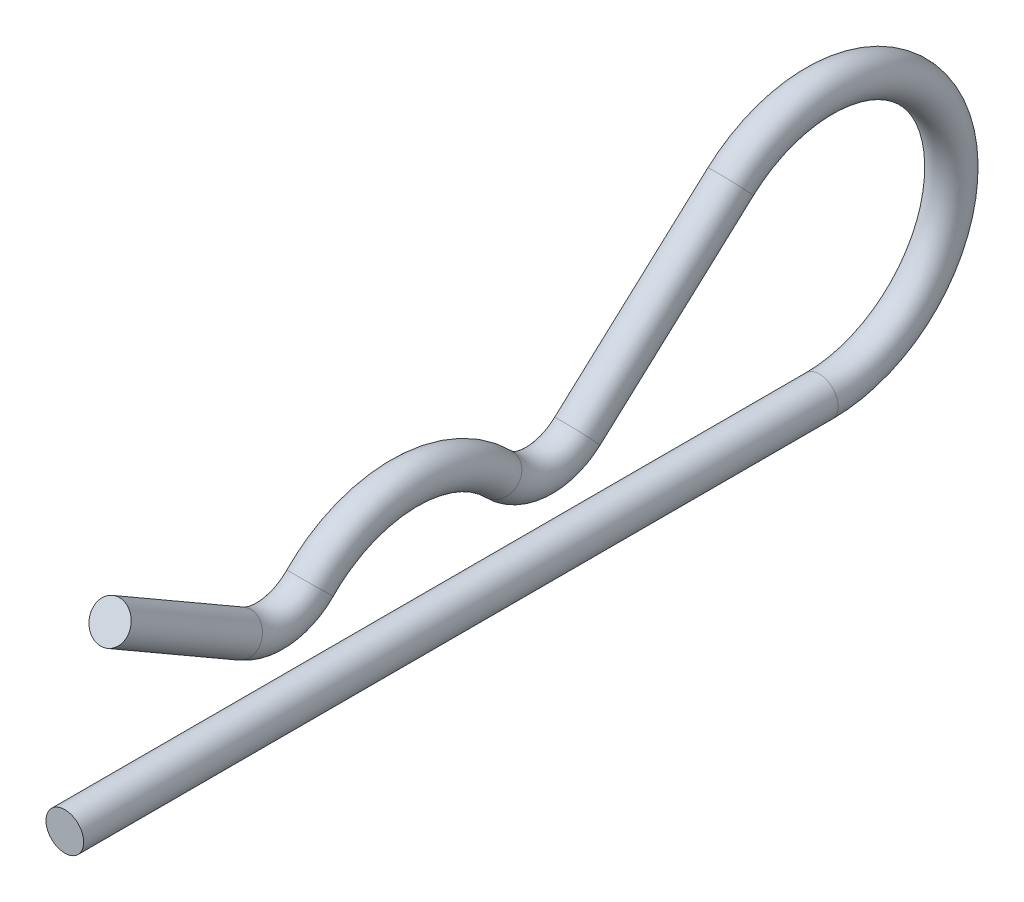
ISO-10303-21;
HEADER;
FILE_DESCRIPTION(('STEP AP214'),'2;1');
FILE_NAME('part.step','',(''),(''),'','','');
FILE_SCHEMA(('AUTOMOTIVE_DESIGN { 1 0 10303 214 1 1 1 1 }'));
ENDSEC;
DATA;
#1=APPLICATION_CONTEXT('core data for automotive mechanical design processes');
#2=APPLICATION_PROTOCOL_DEFINITION('international standard','automotive_design',2000,#1);
#3=PRODUCT_CONTEXT('',#1,'mechanical');
#4=PRODUCT('Part','Part','',(#3));
#5=PRODUCT_RELATED_PRODUCT_CATEGORY('part','',(#4));
#6=PRODUCT_DEFINITION_FORMATION('','',#4);
#7=PRODUCT_DEFINITION_CONTEXT('part definition',#1,'design');
#8=PRODUCT_DEFINITION('design','',#6,#7);
#9=PRODUCT_DEFINITION_SHAPE('','',#8);
#10=(LENGTH_UNIT() NAMED_UNIT(*) SI_UNIT(.MILLI.,.METRE.));
#11=(NAMED_UNIT(*) PLANE_ANGLE_UNIT() SI_UNIT($,.RADIAN.));
#12=(NAMED_UNIT(*) SI_UNIT($,.STERADIAN.) SOLID_ANGLE_UNIT());
#13=UNCERTAINTY_MEASURE_WITH_UNIT(LENGTH_MEASURE(1.E-05),#10,'distance_accuracy_value','');
#14=(GEOMETRIC_REPRESENTATION_CONTEXT(3) GLOBAL_UNCERTAINTY_ASSIGNED_CONTEXT((#13)) GLOBAL_UNIT_ASSIGNED_CONTEXT((#10,
#11,#12)) REPRESENTATION_CONTEXT('',''));
#15=CARTESIAN_POINT('',(0.,0.,0.));
#16=DIRECTION('',(0.,0.,1.));
#17=DIRECTION('',(1.,0.,0.));
#18=AXIS2_PLACEMENT_3D('',#15,#16,#17);
#19=CARTESIAN_POINT('',(0.,0.,36.));
#20=DIRECTION('',(0.,0.,1.));
#21=DIRECTION('',(1.,0.,0.));
#22=AXIS2_PLACEMENT_3D('',#19,#20,#21);
#23=PLANE('',#22);
#24=CARTESIAN_POINT('',(0.,0.,36.));
#25=DIRECTION('',(0.,0.,1.));
#26=DIRECTION('',(1.,0.,0.));
#27=AXIS2_PLACEMENT_3D('',#24,#25,#26);
#28=CIRCLE('',#27,1.5);
#29=CARTESIAN_POINT('',(1.5,0.,36.));
#30=VERTEX_POINT('',#29);
#31=EDGE_CURVE('E47',#30,#30,#28,.T.);
#32=ORIENTED_EDGE('',*,*,#31,.T.);
#33=EDGE_LOOP('',(#32));
#34=FACE_BOUND('',#33,.T.);
#35=ADVANCED_FACE('F35',(#34),#23,.T.);
#36=CARTESIAN_POINT('',(0.,12.629185437904,32.4));
#37=DIRECTION('',(0.,-0.499999999999991,-0.866025403784444));
#38=DIRECTION('',(1.,0.,0.));
#39=AXIS2_PLACEMENT_3D('',#36,#37,#38);
#40=PLANE('',#39);
#41=CARTESIAN_POINT('',(0.,12.629185437904,32.4));
#42=DIRECTION('',(0.,-0.499999999999991,-0.866025403784444));
#43=DIRECTION('',(1.,0.,0.));
#44=AXIS2_PLACEMENT_3D('',#41,#42,#43);
#45=CIRCLE('',#44,1.5);
#46=CARTESIAN_POINT('',(1.5,12.629185437904,32.4));
#47=VERTEX_POINT('',#46);
#48=EDGE_CURVE('E11',#47,#47,#45,.T.);
#49=ORIENTED_EDGE('',*,*,#48,.F.);
#50=EDGE_LOOP('',(#49));
#51=FACE_BOUND('',#50,.T.);
#52=ADVANCED_FACE('F53',(#51),#40,.F.);
#53=CARTESIAN_POINT('',(0.,0.,36.));
#54=DIRECTION('',(0.,0.,-1.));
#55=DIRECTION('',(0.,1.,0.));
#56=AXIS2_PLACEMENT_3D('',#53,#54,#55);
#57=CYLINDRICAL_SURFACE('',#56,1.5);
#58=CARTESIAN_POINT('',(0.,0.,-24.));
#59=DIRECTION('',(0.,0.,1.));
#60=DIRECTION('',(1.,0.,0.));
#61=AXIS2_PLACEMENT_3D('',#58,#59,#60);
#62=CIRCLE('',#61,1.5);
#63=CARTESIAN_POINT('',(0.,-1.50000000000004,-24.));
#64=VERTEX_POINT('',#63);
#65=EDGE_CURVE('E95',#64,#64,#62,.T.);
#66=ORIENTED_EDGE('',*,*,#65,.T.);
#67=EDGE_LOOP('',(#66));
#68=FACE_BOUND('',#67,.T.);
#69=ORIENTED_EDGE('',*,*,#31,.F.);
#70=EDGE_LOOP('',(#69));
#71=FACE_BOUND('',#70,.T.);
#72=ADVANCED_FACE('F55',(#68,#71),#57,.T.);
#73=CARTESIAN_POINT('',(0.,10.5,-24.));
#74=DIRECTION('',(1.,0.,0.));
#75=DIRECTION('',(0.,0.,-1.));
#76=AXIS2_PLACEMENT_3D('',#73,#74,#75);
#77=TOROIDAL_SURFACE('',#76,10.5,1.5);
#78=CARTESIAN_POINT('',(0.,18.2661294554401,-16.9333718591293));
#79=DIRECTION('',(0.,0.673012203892445,-0.739631376708583));
#80=DIRECTION('',(1.,0.,0.));
#81=AXIS2_PLACEMENT_3D('',#78,#79,#80);
#82=CIRCLE('',#81,1.5);
#83=CARTESIAN_POINT('',(0.,19.375576520503,-15.9238535532907));
#84=VERTEX_POINT('',#83);
#85=EDGE_CURVE('E92',#84,#84,#82,.T.);
#86=CARTESIAN_POINT('',(0.,10.5,-24.));
#87=DIRECTION('',(1.,0.,0.));
#88=DIRECTION('',(0.,0.,-1.));
#89=AXIS2_PLACEMENT_3D('',#86,#87,#88);
#90=CIRCLE('',#89,12.);
#91=EDGE_CURVE('',#64,#84,#90,.T.);
#92=ORIENTED_EDGE('',*,*,#65,.F.);
#93=ORIENTED_EDGE('',*,*,#85,.T.);
#94=ORIENTED_EDGE('',*,*,#91,.T.);
#95=ORIENTED_EDGE('',*,*,#91,.F.);
#96=EDGE_LOOP('',(#92,#94,#93,#95));
#97=FACE_BOUND('',#96,.T.);
#98=ADVANCED_FACE('F60',(#97),#77,.T.);
#99=CARTESIAN_POINT('',(0.,18.2661294554401,-16.9333718591293));
#100=DIRECTION('',(0.,-0.673012203892444,0.739631376708584));
#101=DIRECTION('',(0.,-0.739631376708584,-0.673012203892445));
#102=AXIS2_PLACEMENT_3D('',#99,#100,#101);
#103=CYLINDRICAL_SURFACE('',#102,1.5);
#104=CARTESIAN_POINT('',(0.,7.17165880481137,-4.74069756033028));
#105=DIRECTION('',(0.,0.673012203892444,-0.739631376708584));
#106=DIRECTION('',(1.,0.,0.));
#107=AXIS2_PLACEMENT_3D('',#104,#105,#106);
#108=CIRCLE('',#107,1.5);
#109=CARTESIAN_POINT('',(0.,6.06221173974851,-5.75021586616894));
#110=VERTEX_POINT('',#109);
#111=EDGE_CURVE('E97',#110,#110,#108,.T.);
#112=ORIENTED_EDGE('',*,*,#111,.T.);
#113=EDGE_LOOP('',(#112));
#114=FACE_BOUND('',#113,.T.);
#115=ORIENTED_EDGE('',*,*,#85,.F.);
#116=EDGE_LOOP('',(#115));
#117=FACE_BOUND('',#116,.T.);
#118=ADVANCED_FACE('F80',(#114,#117),#103,.T.);
#119=CARTESIAN_POINT('',(0.,10.5,-1.71214264281428));
#120=DIRECTION('',(-1.,0.,0.));
#121=DIRECTION('',(0.,0.,1.));
#122=AXIS2_PLACEMENT_3D('',#119,#120,#121);
#123=TOROIDAL_SURFACE('',#122,4.49999999999999,1.5);
#124=CARTESIAN_POINT('',(0.,7.35,1.50150015003));
#125=DIRECTION('',(0.,-0.714142842854285,-0.7));
#126=DIRECTION('',(1.,0.,0.));
#127=AXIS2_PLACEMENT_3D('',#124,#125,#126);
#128=CIRCLE('',#127,1.5);
#129=CARTESIAN_POINT('',(0.,6.3,2.57271441431143));
#130=VERTEX_POINT('',#129);
#131=EDGE_CURVE('E103',#130,#130,#128,.T.);
#132=CARTESIAN_POINT('',(0.,10.5,-1.71214264281428));
#133=DIRECTION('',(-1.,0.,0.));
#134=DIRECTION('',(0.,0.,1.));
#135=AXIS2_PLACEMENT_3D('',#132,#133,#134);
#136=CIRCLE('',#135,5.99999999999999);
#137=EDGE_CURVE('',#110,#130,#136,.T.);
#138=ORIENTED_EDGE('',*,*,#111,.F.);
#139=ORIENTED_EDGE('',*,*,#131,.T.);
#140=ORIENTED_EDGE('',*,*,#137,.T.);
#141=ORIENTED_EDGE('',*,*,#137,.F.);
#142=EDGE_LOOP('',(#138,#140,#139,#141));
#143=FACE_BOUND('',#142,.T.);
#144=ADVANCED_FACE('F76',(#143),#123,.T.);
#145=CARTESIAN_POINT('',(0.,0.,9.));
#146=DIRECTION('',(1.,0.,0.));
#147=DIRECTION('',(0.,0.,-1.));
#148=AXIS2_PLACEMENT_3D('',#145,#146,#147);
#149=TOROIDAL_SURFACE('',#148,10.5,1.5);
#150=CARTESIAN_POINT('',(0.,7.35,16.49849984997));
#151=DIRECTION('',(0.,0.714142842854285,-0.7));
#152=DIRECTION('',(1.,0.,0.));
#153=AXIS2_PLACEMENT_3D('',#150,#151,#152);
#154=CIRCLE('',#153,1.5);
#155=CARTESIAN_POINT('',(0.,6.29999999999999,15.4272855856886));
#156=VERTEX_POINT('',#155);
#157=EDGE_CURVE('E106',#156,#156,#154,.T.);
#158=ORIENTED_EDGE('',*,*,#157,.T.);
#159=EDGE_LOOP('',(#158));
#160=FACE_BOUND('',#159,.T.);
#161=ORIENTED_EDGE('',*,*,#131,.F.);
#162=EDGE_LOOP('',(#161));
#163=FACE_BOUND('',#162,.T.);
#164=ADVANCED_FACE('F70',(#160,#163),#149,.T.);
#165=CARTESIAN_POINT('',(0.,10.5,19.7121426428143));
#166=DIRECTION('',(-1.,0.,0.));
#167=DIRECTION('',(0.,0.,1.));
#168=AXIS2_PLACEMENT_3D('',#165,#166,#167);
#169=TOROIDAL_SURFACE('',#168,4.5,1.5);
#170=CARTESIAN_POINT('',(0.,6.60288568297,21.9621426428142));
#171=DIRECTION('',(0.,-0.49999999999999,-0.866025403784445));
#172=DIRECTION('',(1.,0.,0.));
#173=AXIS2_PLACEMENT_3D('',#170,#171,#172);
#174=CIRCLE('',#173,1.5);
#175=CARTESIAN_POINT('',(0.,5.30384757729333,22.7121426428142));
#176=VERTEX_POINT('',#175);
#177=EDGE_CURVE('E42',#176,#176,#174,.T.);
#178=CARTESIAN_POINT('',(0.,10.5,19.7121426428143));
#179=DIRECTION('',(-1.,0.,0.));
#180=DIRECTION('',(0.,0.,1.));
#181=AXIS2_PLACEMENT_3D('',#178,#179,#180);
#182=CIRCLE('',#181,6.);
#183=EDGE_CURVE('',#156,#176,#182,.T.);
#184=ORIENTED_EDGE('',*,*,#157,.F.);
#185=ORIENTED_EDGE('',*,*,#177,.T.);
#186=ORIENTED_EDGE('',*,*,#183,.T.);
#187=ORIENTED_EDGE('',*,*,#183,.F.);
#188=EDGE_LOOP('',(#184,#186,#185,#187));
#189=FACE_BOUND('',#188,.T.);
#190=ADVANCED_FACE('F66',(#189),#169,.T.);
#191=CARTESIAN_POINT('',(0.,6.60288568297,21.9621426428142));
#192=DIRECTION('',(0.,0.499999999999991,0.866025403784444));
#193=DIRECTION('',(0.,-0.866025403784444,0.499999999999991));
#194=AXIS2_PLACEMENT_3D('',#191,#192,#193);
#195=CYLINDRICAL_SURFACE('',#194,1.5);
#196=ORIENTED_EDGE('',*,*,#48,.T.);
#197=EDGE_LOOP('',(#196));
#198=FACE_BOUND('',#197,.T.);
#199=ORIENTED_EDGE('',*,*,#177,.F.);
#200=EDGE_LOOP('',(#199));
#201=FACE_BOUND('',#200,.T.);
#202=ADVANCED_FACE('F50',(#198,#201),#195,.T.);
#203=CLOSED_SHELL('',(#35,#52,#72,#98,#118,#144,#164,#190,#202));
#204=MANIFOLD_SOLID_BREP('B2',#203);
#205=ADVANCED_BREP_SHAPE_REPRESENTATION('',(#18,#204),#14);
#206=SHAPE_DEFINITION_REPRESENTATION(#9,#205);
ENDSEC;
END-ISO-10303-21;
